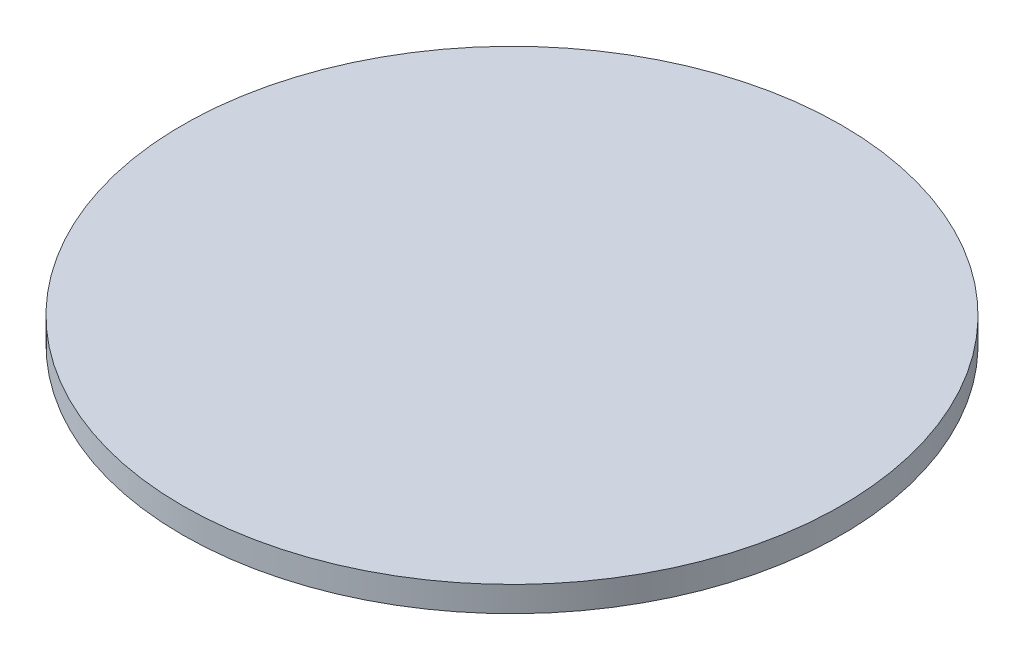
ISO-10303-21;
HEADER;
FILE_DESCRIPTION(('STEP AP214'),'2;1');
FILE_NAME('part.step','',(''),(''),'','','');
FILE_SCHEMA(('AUTOMOTIVE_DESIGN { 1 0 10303 214 1 1 1 1 }'));
ENDSEC;
DATA;
#1=APPLICATION_CONTEXT('core data for automotive mechanical design processes');
#2=APPLICATION_PROTOCOL_DEFINITION('international standard','automotive_design',2000,#1);
#3=PRODUCT_CONTEXT('',#1,'mechanical');
#4=PRODUCT('Part','Part','',(#3));
#5=PRODUCT_RELATED_PRODUCT_CATEGORY('part','',(#4));
#6=PRODUCT_DEFINITION_FORMATION('','',#4);
#7=PRODUCT_DEFINITION_CONTEXT('part definition',#1,'design');
#8=PRODUCT_DEFINITION('design','',#6,#7);
#9=PRODUCT_DEFINITION_SHAPE('','',#8);
#10=(LENGTH_UNIT() NAMED_UNIT(*) SI_UNIT(.MILLI.,.METRE.));
#11=(NAMED_UNIT(*) PLANE_ANGLE_UNIT() SI_UNIT($,.RADIAN.));
#12=(NAMED_UNIT(*) SI_UNIT($,.STERADIAN.) SOLID_ANGLE_UNIT());
#13=UNCERTAINTY_MEASURE_WITH_UNIT(LENGTH_MEASURE(1.E-05),#10,'distance_accuracy_value','');
#14=(GEOMETRIC_REPRESENTATION_CONTEXT(3) GLOBAL_UNCERTAINTY_ASSIGNED_CONTEXT((#13)) GLOBAL_UNIT_ASSIGNED_CONTEXT((#10,
#11,#12)) REPRESENTATION_CONTEXT('',''));
#15=CARTESIAN_POINT('',(0.,0.,0.));
#16=DIRECTION('',(0.,0.,1.));
#17=DIRECTION('',(1.,0.,0.));
#18=AXIS2_PLACEMENT_3D('',#15,#16,#17);
#19=CARTESIAN_POINT('',(0.,6.35,0.));
#20=DIRECTION('',(0.,-1.,0.));
#21=DIRECTION('',(0.,0.,-1.));
#22=AXIS2_PLACEMENT_3D('',#19,#20,#21);
#23=CYLINDRICAL_SURFACE('',#22,82.55);
#24=CARTESIAN_POINT('',(0.,6.35,0.));
#25=DIRECTION('',(0.,1.,0.));
#26=DIRECTION('',(0.,0.,1.));
#27=AXIS2_PLACEMENT_3D('',#24,#25,#26);
#28=CIRCLE('',#27,82.55);
#29=CARTESIAN_POINT('',(0.,6.35,82.55));
#30=VERTEX_POINT('',#29);
#31=EDGE_CURVE('E10',#30,#30,#28,.T.);
#32=ORIENTED_EDGE('',*,*,#31,.F.);
#33=EDGE_LOOP('',(#32));
#34=FACE_BOUND('',#33,.T.);
#35=CARTESIAN_POINT('',(0.,0.,0.));
#36=DIRECTION('',(0.,1.,0.));
#37=DIRECTION('',(0.,0.,1.));
#38=AXIS2_PLACEMENT_3D('',#35,#36,#37);
#39=CIRCLE('',#38,82.55);
#40=CARTESIAN_POINT('',(0.,0.,82.55));
#41=VERTEX_POINT('',#40);
#42=EDGE_CURVE('E40',#41,#41,#39,.T.);
#43=ORIENTED_EDGE('',*,*,#42,.T.);
#44=EDGE_LOOP('',(#43));
#45=FACE_BOUND('',#44,.T.);
#46=ADVANCED_FACE('F37',(#34,#45),#23,.T.);
#47=CARTESIAN_POINT('',(0.,6.35,0.));
#48=DIRECTION('',(0.,1.,0.));
#49=DIRECTION('',(0.,0.,1.));
#50=AXIS2_PLACEMENT_3D('',#47,#48,#49);
#51=PLANE('',#50);
#52=ORIENTED_EDGE('',*,*,#31,.T.);
#53=EDGE_LOOP('',(#52));
#54=FACE_BOUND('',#53,.T.);
#55=ADVANCED_FACE('F54',(#54),#51,.T.);
#56=CARTESIAN_POINT('',(0.,0.,0.));
#57=DIRECTION('',(0.,1.,0.));
#58=DIRECTION('',(0.,0.,1.));
#59=AXIS2_PLACEMENT_3D('',#56,#57,#58);
#60=PLANE('',#59);
#61=ORIENTED_EDGE('',*,*,#42,.F.);
#62=EDGE_LOOP('',(#61));
#63=FACE_BOUND('',#62,.T.);
#64=ADVANCED_FACE('F52',(#63),#60,.F.);
#65=CLOSED_SHELL('',(#46,#55,#64));
#66=MANIFOLD_SOLID_BREP('B2',#65);
#67=ADVANCED_BREP_SHAPE_REPRESENTATION('',(#18,#66),#14);
#68=SHAPE_DEFINITION_REPRESENTATION(#9,#67);
ENDSEC;
END-ISO-10303-21;
